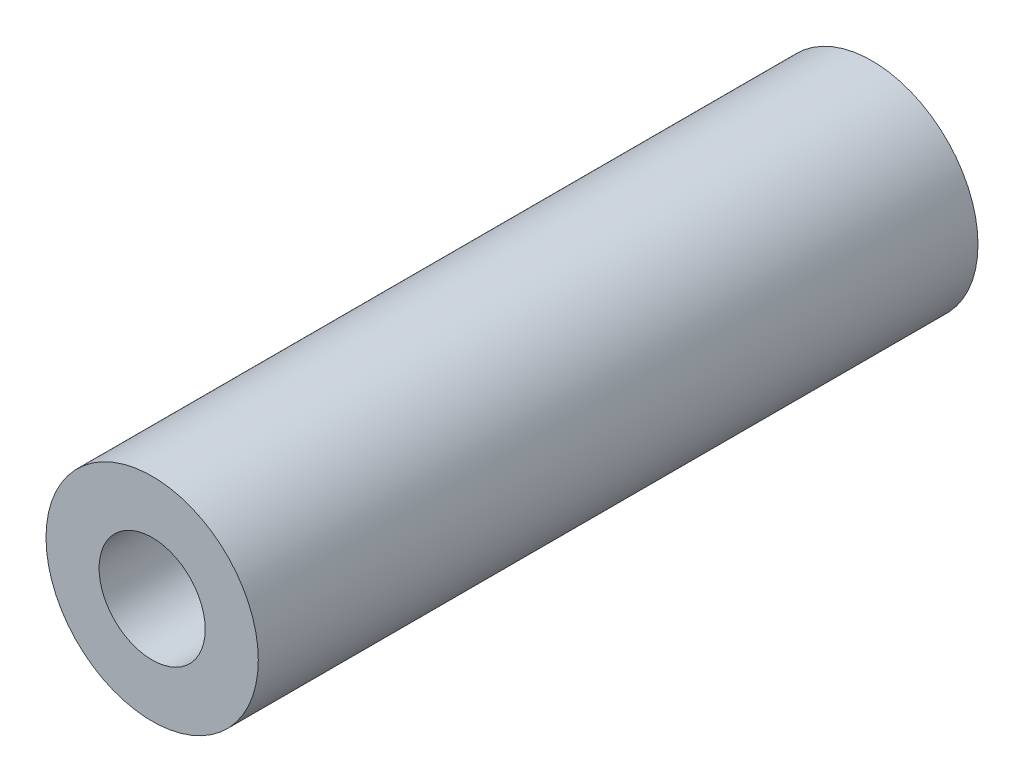
ISO-10303-21;
HEADER;
FILE_DESCRIPTION(('STEP AP214'),'2;1');
FILE_NAME('part.step','',(''),(''),'','','');
FILE_SCHEMA(('AUTOMOTIVE_DESIGN { 1 0 10303 214 1 1 1 1 }'));
ENDSEC;
DATA;
#1=APPLICATION_CONTEXT('core data for automotive mechanical design processes');
#2=APPLICATION_PROTOCOL_DEFINITION('international standard','automotive_design',2000,#1);
#3=PRODUCT_CONTEXT('',#1,'mechanical');
#4=PRODUCT('Part','Part','',(#3));
#5=PRODUCT_RELATED_PRODUCT_CATEGORY('part','',(#4));
#6=PRODUCT_DEFINITION_FORMATION('','',#4);
#7=PRODUCT_DEFINITION_CONTEXT('part definition',#1,'design');
#8=PRODUCT_DEFINITION('design','',#6,#7);
#9=PRODUCT_DEFINITION_SHAPE('','',#8);
#10=(LENGTH_UNIT() NAMED_UNIT(*) SI_UNIT(.MILLI.,.METRE.));
#11=(NAMED_UNIT(*) PLANE_ANGLE_UNIT() SI_UNIT($,.RADIAN.));
#12=(NAMED_UNIT(*) SI_UNIT($,.STERADIAN.) SOLID_ANGLE_UNIT());
#13=UNCERTAINTY_MEASURE_WITH_UNIT(LENGTH_MEASURE(1.E-05),#10,'distance_accuracy_value','');
#14=(GEOMETRIC_REPRESENTATION_CONTEXT(3) GLOBAL_UNCERTAINTY_ASSIGNED_CONTEXT((#13)) GLOBAL_UNIT_ASSIGNED_CONTEXT((#10,
#11,#12)) REPRESENTATION_CONTEXT('',''));
#15=CARTESIAN_POINT('',(0.,0.,0.));
#16=DIRECTION('',(0.,0.,1.));
#17=DIRECTION('',(1.,0.,0.));
#18=AXIS2_PLACEMENT_3D('',#15,#16,#17);
#19=CARTESIAN_POINT('',(0.,0.,33.9));
#20=DIRECTION('',(0.,0.,-1.));
#21=DIRECTION('',(-1.,0.,0.));
#22=AXIS2_PLACEMENT_3D('',#19,#20,#21);
#23=CYLINDRICAL_SURFACE('',#22,5.);
#24=CARTESIAN_POINT('',(0.,0.,33.9));
#25=DIRECTION('',(0.,0.,1.));
#26=DIRECTION('',(1.,0.,0.));
#27=AXIS2_PLACEMENT_3D('',#24,#25,#26);
#28=CIRCLE('',#27,5.);
#29=CARTESIAN_POINT('',(5.,0.,33.9));
#30=VERTEX_POINT('',#29);
#31=EDGE_CURVE('E10',#30,#30,#28,.T.);
#32=ORIENTED_EDGE('',*,*,#31,.F.);
#33=EDGE_LOOP('',(#32));
#34=FACE_BOUND('',#33,.T.);
#35=CARTESIAN_POINT('',(0.,0.,0.));
#36=DIRECTION('',(0.,0.,1.));
#37=DIRECTION('',(1.,0.,0.));
#38=AXIS2_PLACEMENT_3D('',#35,#36,#37);
#39=CIRCLE('',#38,5.);
#40=CARTESIAN_POINT('',(5.,0.,0.));
#41=VERTEX_POINT('',#40);
#42=EDGE_CURVE('E36',#41,#41,#39,.T.);
#43=ORIENTED_EDGE('',*,*,#42,.T.);
#44=EDGE_LOOP('',(#43));
#45=FACE_BOUND('',#44,.T.);
#46=ADVANCED_FACE('F33',(#34,#45),#23,.T.);
#47=CARTESIAN_POINT('',(0.,0.,33.9));
#48=DIRECTION('',(0.,0.,1.));
#49=DIRECTION('',(1.,0.,0.));
#50=AXIS2_PLACEMENT_3D('',#47,#48,#49);
#51=PLANE('',#50);
#52=CARTESIAN_POINT('',(0.,0.,33.9));
#53=DIRECTION('',(0.,0.,1.));
#54=DIRECTION('',(1.,0.,0.));
#55=AXIS2_PLACEMENT_3D('',#52,#53,#54);
#56=CIRCLE('',#55,2.5);
#57=CARTESIAN_POINT('',(2.5,0.,33.9));
#58=VERTEX_POINT('',#57);
#59=EDGE_CURVE('E47',#58,#58,#56,.T.);
#60=ORIENTED_EDGE('',*,*,#59,.F.);
#61=EDGE_LOOP('',(#60));
#62=FACE_BOUND('',#61,.T.);
#63=ORIENTED_EDGE('',*,*,#31,.T.);
#64=EDGE_LOOP('',(#63));
#65=FACE_BOUND('',#64,.T.);
#66=ADVANCED_FACE('F53',(#62,#65),#51,.T.);
#67=CARTESIAN_POINT('',(0.,0.,0.));
#68=DIRECTION('',(0.,0.,1.));
#69=DIRECTION('',(1.,0.,0.));
#70=AXIS2_PLACEMENT_3D('',#67,#68,#69);
#71=PLANE('',#70);
#72=CARTESIAN_POINT('',(0.,0.,0.));
#73=DIRECTION('',(0.,0.,1.));
#74=DIRECTION('',(1.,0.,0.));
#75=AXIS2_PLACEMENT_3D('',#72,#73,#74);
#76=CIRCLE('',#75,2.5);
#77=CARTESIAN_POINT('',(2.5,0.,0.));
#78=VERTEX_POINT('',#77);
#79=EDGE_CURVE('E43',#78,#78,#76,.T.);
#80=ORIENTED_EDGE('',*,*,#79,.T.);
#81=EDGE_LOOP('',(#80));
#82=FACE_BOUND('',#81,.T.);
#83=ORIENTED_EDGE('',*,*,#42,.F.);
#84=EDGE_LOOP('',(#83));
#85=FACE_BOUND('',#84,.T.);
#86=ADVANCED_FACE('F55',(#82,#85),#71,.F.);
#87=CARTESIAN_POINT('',(0.,0.,33.9));
#88=DIRECTION('',(0.,0.,1.));
#89=DIRECTION('',(1.,0.,0.));
#90=AXIS2_PLACEMENT_3D('',#87,#88,#89);
#91=CYLINDRICAL_SURFACE('',#90,2.5);
#92=ORIENTED_EDGE('',*,*,#79,.F.);
#93=EDGE_LOOP('',(#92));
#94=FACE_BOUND('',#93,.T.);
#95=ORIENTED_EDGE('',*,*,#59,.T.);
#96=EDGE_LOOP('',(#95));
#97=FACE_BOUND('',#96,.T.);
#98=ADVANCED_FACE('F51',(#94,#97),#91,.F.);
#99=CLOSED_SHELL('',(#46,#66,#86,#98));
#100=MANIFOLD_SOLID_BREP('B2',#99);
#101=ADVANCED_BREP_SHAPE_REPRESENTATION('',(#18,#100),#14);
#102=SHAPE_DEFINITION_REPRESENTATION(#9,#101);
ENDSEC;
END-ISO-10303-21;
